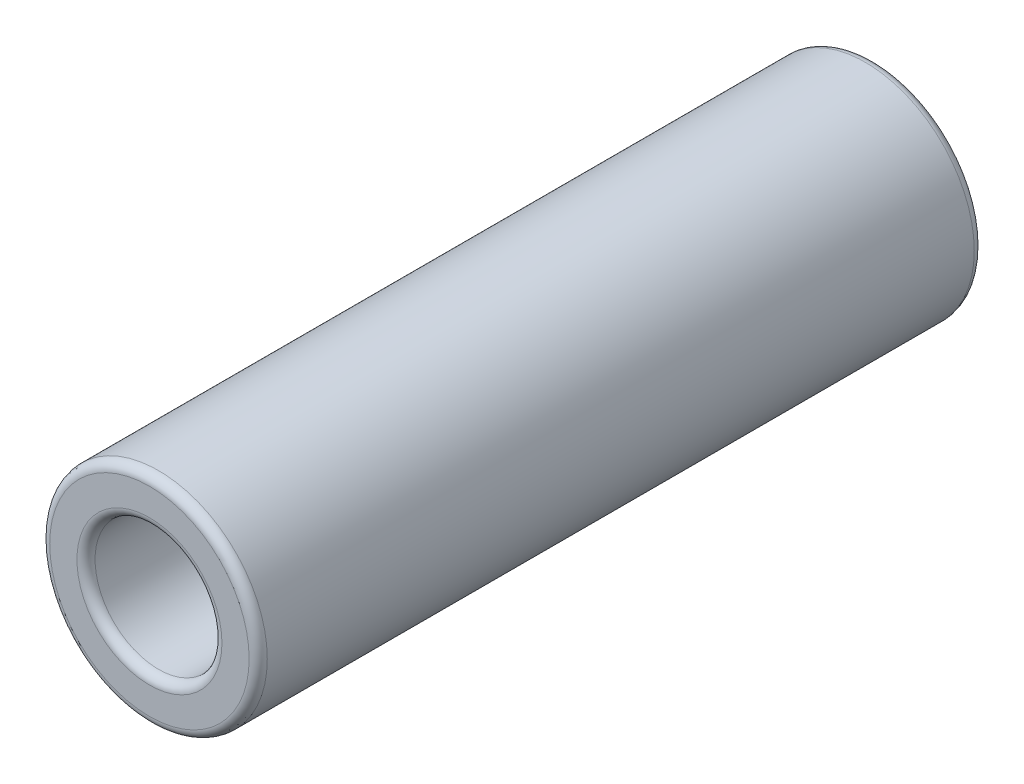
ISO-10303-21;
HEADER;
FILE_DESCRIPTION(('STEP AP214'),'2;1');
FILE_NAME('part.step','',(''),(''),'','','');
FILE_SCHEMA(('AUTOMOTIVE_DESIGN { 1 0 10303 214 1 1 1 1 }'));
ENDSEC;
DATA;
#1=APPLICATION_CONTEXT('core data for automotive mechanical design processes');
#2=APPLICATION_PROTOCOL_DEFINITION('international standard','automotive_design',2000,#1);
#3=PRODUCT_CONTEXT('',#1,'mechanical');
#4=PRODUCT('Part','Part','',(#3));
#5=PRODUCT_RELATED_PRODUCT_CATEGORY('part','',(#4));
#6=PRODUCT_DEFINITION_FORMATION('','',#4);
#7=PRODUCT_DEFINITION_CONTEXT('part definition',#1,'design');
#8=PRODUCT_DEFINITION('design','',#6,#7);
#9=PRODUCT_DEFINITION_SHAPE('','',#8);
#10=(LENGTH_UNIT() NAMED_UNIT(*) SI_UNIT(.MILLI.,.METRE.));
#11=(NAMED_UNIT(*) PLANE_ANGLE_UNIT() SI_UNIT($,.RADIAN.));
#12=(NAMED_UNIT(*) SI_UNIT($,.STERADIAN.) SOLID_ANGLE_UNIT());
#13=UNCERTAINTY_MEASURE_WITH_UNIT(LENGTH_MEASURE(1.E-05),#10,'distance_accuracy_value','');
#14=(GEOMETRIC_REPRESENTATION_CONTEXT(3) GLOBAL_UNCERTAINTY_ASSIGNED_CONTEXT((#13)) GLOBAL_UNIT_ASSIGNED_CONTEXT((#10,
#11,#12)) REPRESENTATION_CONTEXT('',''));
#15=CARTESIAN_POINT('',(0.,0.,0.));
#16=DIRECTION('',(0.,0.,1.));
#17=DIRECTION('',(1.,0.,0.));
#18=AXIS2_PLACEMENT_3D('',#15,#16,#17);
#19=CARTESIAN_POINT('',(0.,0.,40.));
#20=DIRECTION('',(0.,0.,1.));
#21=DIRECTION('',(1.,0.,0.));
#22=AXIS2_PLACEMENT_3D('',#19,#20,#21);
#23=PLANE('',#22);
#24=CARTESIAN_POINT('',(0.,0.,40.));
#25=DIRECTION('',(0.,0.,1.));
#26=DIRECTION('',(1.,0.,0.));
#27=AXIS2_PLACEMENT_3D('',#24,#25,#26);
#28=CIRCLE('',#27,4.);
#29=CARTESIAN_POINT('',(4.,0.,40.));
#30=VERTEX_POINT('',#29);
#31=EDGE_CURVE('E51',#30,#30,#28,.F.);
#32=ORIENTED_EDGE('',*,*,#31,.T.);
#33=EDGE_LOOP('',(#32));
#34=FACE_BOUND('',#33,.T.);
#35=CARTESIAN_POINT('',(0.,0.,40.));
#36=DIRECTION('',(0.,0.,1.));
#37=DIRECTION('',(1.,0.,0.));
#38=AXIS2_PLACEMENT_3D('',#35,#36,#37);
#39=CIRCLE('',#38,5.5);
#40=CARTESIAN_POINT('',(5.5,0.,40.));
#41=VERTEX_POINT('',#40);
#42=EDGE_CURVE('E54',#41,#41,#39,.T.);
#43=ORIENTED_EDGE('',*,*,#42,.T.);
#44=EDGE_LOOP('',(#43));
#45=FACE_BOUND('',#44,.T.);
#46=ADVANCED_FACE('F31',(#34,#45),#23,.T.);
#47=CARTESIAN_POINT('',(0.,0.,0.));
#48=DIRECTION('',(0.,0.,1.));
#49=DIRECTION('',(1.,0.,0.));
#50=AXIS2_PLACEMENT_3D('',#47,#48,#49);
#51=PLANE('',#50);
#52=CARTESIAN_POINT('',(0.,0.,0.));
#53=DIRECTION('',(0.,0.,1.));
#54=DIRECTION('',(1.,0.,0.));
#55=AXIS2_PLACEMENT_3D('',#52,#53,#54);
#56=CIRCLE('',#55,4.);
#57=CARTESIAN_POINT('',(4.,0.,0.));
#58=VERTEX_POINT('',#57);
#59=EDGE_CURVE('E10',#58,#58,#56,.T.);
#60=ORIENTED_EDGE('',*,*,#59,.T.);
#61=EDGE_LOOP('',(#60));
#62=FACE_BOUND('',#61,.T.);
#63=CARTESIAN_POINT('',(0.,0.,0.));
#64=DIRECTION('',(0.,0.,1.));
#65=DIRECTION('',(1.,0.,0.));
#66=AXIS2_PLACEMENT_3D('',#63,#64,#65);
#67=CIRCLE('',#66,5.5);
#68=CARTESIAN_POINT('',(5.5,0.,0.));
#69=VERTEX_POINT('',#68);
#70=EDGE_CURVE('E38',#69,#69,#67,.F.);
#71=ORIENTED_EDGE('',*,*,#70,.T.);
#72=EDGE_LOOP('',(#71));
#73=FACE_BOUND('',#72,.T.);
#74=ADVANCED_FACE('F79',(#62,#73),#51,.F.);
#75=CARTESIAN_POINT('',(0.,0.,40.));
#76=DIRECTION('',(0.,0.,-1.));
#77=DIRECTION('',(-1.,0.,0.));
#78=AXIS2_PLACEMENT_3D('',#75,#76,#77);
#79=CYLINDRICAL_SURFACE('',#78,6.);
#80=CARTESIAN_POINT('',(0.,0.,39.5));
#81=DIRECTION('',(0.,0.,1.));
#82=DIRECTION('',(1.,0.,0.));
#83=AXIS2_PLACEMENT_3D('',#80,#81,#82);
#84=CIRCLE('',#83,6.);
#85=CARTESIAN_POINT('',(6.,0.,39.5));
#86=VERTEX_POINT('',#85);
#87=EDGE_CURVE('E42',#86,#86,#84,.F.);
#88=ORIENTED_EDGE('',*,*,#87,.T.);
#89=EDGE_LOOP('',(#88));
#90=FACE_BOUND('',#89,.T.);
#91=CARTESIAN_POINT('',(0.,0.,0.5));
#92=DIRECTION('',(0.,0.,1.));
#93=DIRECTION('',(1.,0.,0.));
#94=AXIS2_PLACEMENT_3D('',#91,#92,#93);
#95=CIRCLE('',#94,6.);
#96=CARTESIAN_POINT('',(6.,0.,0.5));
#97=VERTEX_POINT('',#96);
#98=EDGE_CURVE('E46',#97,#97,#95,.T.);
#99=ORIENTED_EDGE('',*,*,#98,.T.);
#100=EDGE_LOOP('',(#99));
#101=FACE_BOUND('',#100,.T.);
#102=ADVANCED_FACE('F85',(#90,#101),#79,.T.);
#103=CARTESIAN_POINT('',(0.,0.,40.));
#104=DIRECTION('',(0.,0.,-1.));
#105=DIRECTION('',(-1.,0.,0.));
#106=AXIS2_PLACEMENT_3D('',#103,#104,#105);
#107=CYLINDRICAL_SURFACE('',#106,3.5);
#108=CARTESIAN_POINT('',(0.,0.,39.5));
#109=DIRECTION('',(0.,0.,1.));
#110=DIRECTION('',(1.,0.,0.));
#111=AXIS2_PLACEMENT_3D('',#108,#109,#110);
#112=CIRCLE('',#111,3.5);
#113=CARTESIAN_POINT('',(3.5,0.,39.5));
#114=VERTEX_POINT('',#113);
#115=EDGE_CURVE('E57',#114,#114,#112,.T.);
#116=ORIENTED_EDGE('',*,*,#115,.T.);
#117=EDGE_LOOP('',(#116));
#118=FACE_BOUND('',#117,.T.);
#119=CARTESIAN_POINT('',(0.,0.,0.5));
#120=DIRECTION('',(0.,0.,1.));
#121=DIRECTION('',(1.,0.,0.));
#122=AXIS2_PLACEMENT_3D('',#119,#120,#121);
#123=CIRCLE('',#122,3.5);
#124=CARTESIAN_POINT('',(3.5,0.,0.5));
#125=VERTEX_POINT('',#124);
#126=EDGE_CURVE('E60',#125,#125,#123,.F.);
#127=ORIENTED_EDGE('',*,*,#126,.T.);
#128=EDGE_LOOP('',(#127));
#129=FACE_BOUND('',#128,.T.);
#130=ADVANCED_FACE('F64',(#118,#129),#107,.F.);
#131=CARTESIAN_POINT('',(0.,0.,39.5));
#132=DIRECTION('',(0.,0.,1.));
#133=DIRECTION('',(1.,0.,0.));
#134=AXIS2_PLACEMENT_3D('',#131,#132,#133);
#135=TOROIDAL_SURFACE('',#134,4.,0.5);
#136=ORIENTED_EDGE('',*,*,#31,.F.);
#137=EDGE_LOOP('',(#136));
#138=FACE_BOUND('',#137,.T.);
#139=ORIENTED_EDGE('',*,*,#115,.F.);
#140=EDGE_LOOP('',(#139));
#141=FACE_BOUND('',#140,.T.);
#142=ADVANCED_FACE('F75',(#138,#141),#135,.T.);
#143=CARTESIAN_POINT('',(0.,0.,39.5));
#144=DIRECTION('',(0.,0.,1.));
#145=DIRECTION('',(1.,0.,0.));
#146=AXIS2_PLACEMENT_3D('',#143,#144,#145);
#147=TOROIDAL_SURFACE('',#146,5.5,0.5);
#148=ORIENTED_EDGE('',*,*,#87,.F.);
#149=EDGE_LOOP('',(#148));
#150=FACE_BOUND('',#149,.T.);
#151=ORIENTED_EDGE('',*,*,#42,.F.);
#152=EDGE_LOOP('',(#151));
#153=FACE_BOUND('',#152,.T.);
#154=ADVANCED_FACE('F69',(#150,#153),#147,.T.);
#155=CARTESIAN_POINT('',(0.,0.,0.5));
#156=DIRECTION('',(0.,0.,1.));
#157=DIRECTION('',(1.,0.,0.));
#158=AXIS2_PLACEMENT_3D('',#155,#156,#157);
#159=TOROIDAL_SURFACE('',#158,4.,0.5);
#160=ORIENTED_EDGE('',*,*,#126,.F.);
#161=EDGE_LOOP('',(#160));
#162=FACE_BOUND('',#161,.T.);
#163=ORIENTED_EDGE('',*,*,#59,.F.);
#164=EDGE_LOOP('',(#163));
#165=FACE_BOUND('',#164,.T.);
#166=ADVANCED_FACE('F66',(#162,#165),#159,.T.);
#167=CARTESIAN_POINT('',(0.,0.,0.5));
#168=DIRECTION('',(0.,0.,1.));
#169=DIRECTION('',(1.,0.,0.));
#170=AXIS2_PLACEMENT_3D('',#167,#168,#169);
#171=TOROIDAL_SURFACE('',#170,5.5,0.5);
#172=ORIENTED_EDGE('',*,*,#70,.F.);
#173=EDGE_LOOP('',(#172));
#174=FACE_BOUND('',#173,.T.);
#175=ORIENTED_EDGE('',*,*,#98,.F.);
#176=EDGE_LOOP('',(#175));
#177=FACE_BOUND('',#176,.T.);
#178=ADVANCED_FACE('F33',(#174,#177),#171,.T.);
#179=CLOSED_SHELL('',(#46,#74,#102,#130,#142,#154,#166,#178));
#180=MANIFOLD_SOLID_BREP('B2',#179);
#181=ADVANCED_BREP_SHAPE_REPRESENTATION('',(#18,#180),#14);
#182=SHAPE_DEFINITION_REPRESENTATION(#9,#181);
ENDSEC;
END-ISO-10303-21;
